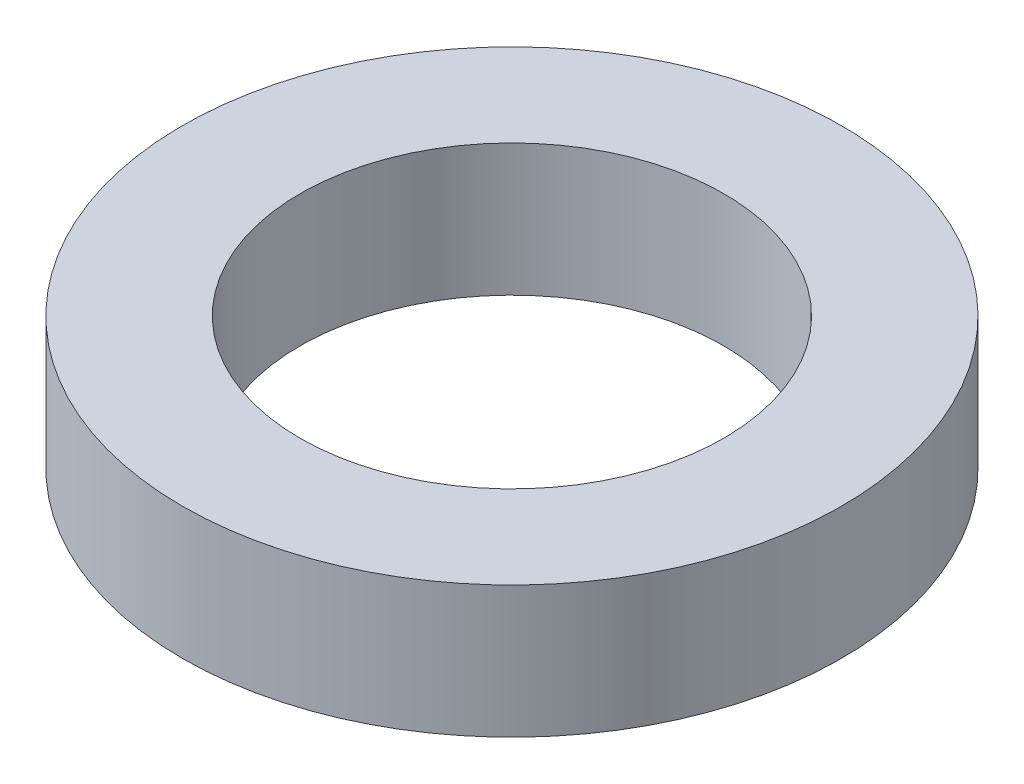
ISO-10303-21;
HEADER;
FILE_DESCRIPTION(('STEP AP214'),'2;1');
FILE_NAME('part.step','',(''),(''),'','','');
FILE_SCHEMA(('AUTOMOTIVE_DESIGN { 1 0 10303 214 1 1 1 1 }'));
ENDSEC;
DATA;
#1=APPLICATION_CONTEXT('core data for automotive mechanical design processes');
#2=APPLICATION_PROTOCOL_DEFINITION('international standard','automotive_design',2000,#1);
#3=PRODUCT_CONTEXT('',#1,'mechanical');
#4=PRODUCT('Part','Part','',(#3));
#5=PRODUCT_RELATED_PRODUCT_CATEGORY('part','',(#4));
#6=PRODUCT_DEFINITION_FORMATION('','',#4);
#7=PRODUCT_DEFINITION_CONTEXT('part definition',#1,'design');
#8=PRODUCT_DEFINITION('design','',#6,#7);
#9=PRODUCT_DEFINITION_SHAPE('','',#8);
#10=(LENGTH_UNIT() NAMED_UNIT(*) SI_UNIT(.MILLI.,.METRE.));
#11=(NAMED_UNIT(*) PLANE_ANGLE_UNIT() SI_UNIT($,.RADIAN.));
#12=(NAMED_UNIT(*) SI_UNIT($,.STERADIAN.) SOLID_ANGLE_UNIT());
#13=UNCERTAINTY_MEASURE_WITH_UNIT(LENGTH_MEASURE(1.E-05),#10,'distance_accuracy_value','');
#14=(GEOMETRIC_REPRESENTATION_CONTEXT(3) GLOBAL_UNCERTAINTY_ASSIGNED_CONTEXT((#13)) GLOBAL_UNIT_ASSIGNED_CONTEXT((#10,
#11,#12)) REPRESENTATION_CONTEXT('',''));
#15=CARTESIAN_POINT('',(0.,0.,0.));
#16=DIRECTION('',(0.,0.,1.));
#17=DIRECTION('',(1.,0.,0.));
#18=AXIS2_PLACEMENT_3D('',#15,#16,#17);
#19=CARTESIAN_POINT('',(0.,14.,0.));
#20=DIRECTION('',(0.,-1.,0.));
#21=DIRECTION('',(0.,0.,-1.));
#22=AXIS2_PLACEMENT_3D('',#19,#20,#21);
#23=CYLINDRICAL_SURFACE('',#22,35.);
#24=CARTESIAN_POINT('',(0.,14.,0.));
#25=DIRECTION('',(0.,1.,0.));
#26=DIRECTION('',(0.,0.,1.));
#27=AXIS2_PLACEMENT_3D('',#24,#25,#26);
#28=CIRCLE('',#27,35.);
#29=CARTESIAN_POINT('',(0.,14.,35.));
#30=VERTEX_POINT('',#29);
#31=EDGE_CURVE('E10',#30,#30,#28,.T.);
#32=ORIENTED_EDGE('',*,*,#31,.F.);
#33=EDGE_LOOP('',(#32));
#34=FACE_BOUND('',#33,.T.);
#35=CARTESIAN_POINT('',(0.,0.,0.));
#36=DIRECTION('',(0.,1.,0.));
#37=DIRECTION('',(0.,0.,1.));
#38=AXIS2_PLACEMENT_3D('',#35,#36,#37);
#39=CIRCLE('',#38,35.);
#40=CARTESIAN_POINT('',(0.,0.,35.));
#41=VERTEX_POINT('',#40);
#42=EDGE_CURVE('E37',#41,#41,#39,.T.);
#43=ORIENTED_EDGE('',*,*,#42,.T.);
#44=EDGE_LOOP('',(#43));
#45=FACE_BOUND('',#44,.T.);
#46=ADVANCED_FACE('F40',(#34,#45),#23,.T.);
#47=CARTESIAN_POINT('',(0.,14.,0.));
#48=DIRECTION('',(0.,1.,0.));
#49=DIRECTION('',(0.,0.,1.));
#50=AXIS2_PLACEMENT_3D('',#47,#48,#49);
#51=PLANE('',#50);
#52=CARTESIAN_POINT('',(0.,14.,0.));
#53=DIRECTION('',(0.,1.,0.));
#54=DIRECTION('',(0.,0.,1.));
#55=AXIS2_PLACEMENT_3D('',#52,#53,#54);
#56=CIRCLE('',#55,22.5);
#57=CARTESIAN_POINT('',(0.,14.,22.5));
#58=VERTEX_POINT('',#57);
#59=EDGE_CURVE('E50',#58,#58,#56,.T.);
#60=ORIENTED_EDGE('',*,*,#59,.F.);
#61=EDGE_LOOP('',(#60));
#62=FACE_BOUND('',#61,.T.);
#63=ORIENTED_EDGE('',*,*,#31,.T.);
#64=EDGE_LOOP('',(#63));
#65=FACE_BOUND('',#64,.T.);
#66=ADVANCED_FACE('F59',(#62,#65),#51,.T.);
#67=CARTESIAN_POINT('',(0.,0.,0.));
#68=DIRECTION('',(0.,1.,0.));
#69=DIRECTION('',(0.,0.,1.));
#70=AXIS2_PLACEMENT_3D('',#67,#68,#69);
#71=PLANE('',#70);
#72=CARTESIAN_POINT('',(0.,0.,0.));
#73=DIRECTION('',(0.,1.,0.));
#74=DIRECTION('',(0.,0.,1.));
#75=AXIS2_PLACEMENT_3D('',#72,#73,#74);
#76=CIRCLE('',#75,22.5);
#77=CARTESIAN_POINT('',(0.,0.,22.5));
#78=VERTEX_POINT('',#77);
#79=EDGE_CURVE('E47',#78,#78,#76,.T.);
#80=ORIENTED_EDGE('',*,*,#79,.T.);
#81=EDGE_LOOP('',(#80));
#82=FACE_BOUND('',#81,.T.);
#83=ORIENTED_EDGE('',*,*,#42,.F.);
#84=EDGE_LOOP('',(#83));
#85=FACE_BOUND('',#84,.T.);
#86=ADVANCED_FACE('F58',(#82,#85),#71,.F.);
#87=CARTESIAN_POINT('',(0.,14.,0.));
#88=DIRECTION('',(0.,-1.,0.));
#89=DIRECTION('',(0.,0.,-1.));
#90=AXIS2_PLACEMENT_3D('',#87,#88,#89);
#91=CYLINDRICAL_SURFACE('',#90,22.5);
#92=ORIENTED_EDGE('',*,*,#59,.T.);
#93=EDGE_LOOP('',(#92));
#94=FACE_BOUND('',#93,.T.);
#95=ORIENTED_EDGE('',*,*,#79,.F.);
#96=EDGE_LOOP('',(#95));
#97=FACE_BOUND('',#96,.T.);
#98=ADVANCED_FACE('F54',(#94,#97),#91,.F.);
#99=CLOSED_SHELL('',(#46,#66,#86,#98));
#100=MANIFOLD_SOLID_BREP('B2',#99);
#101=ADVANCED_BREP_SHAPE_REPRESENTATION('',(#18,#100),#14);
#102=SHAPE_DEFINITION_REPRESENTATION(#9,#101);
ENDSEC;
END-ISO-10303-21;
